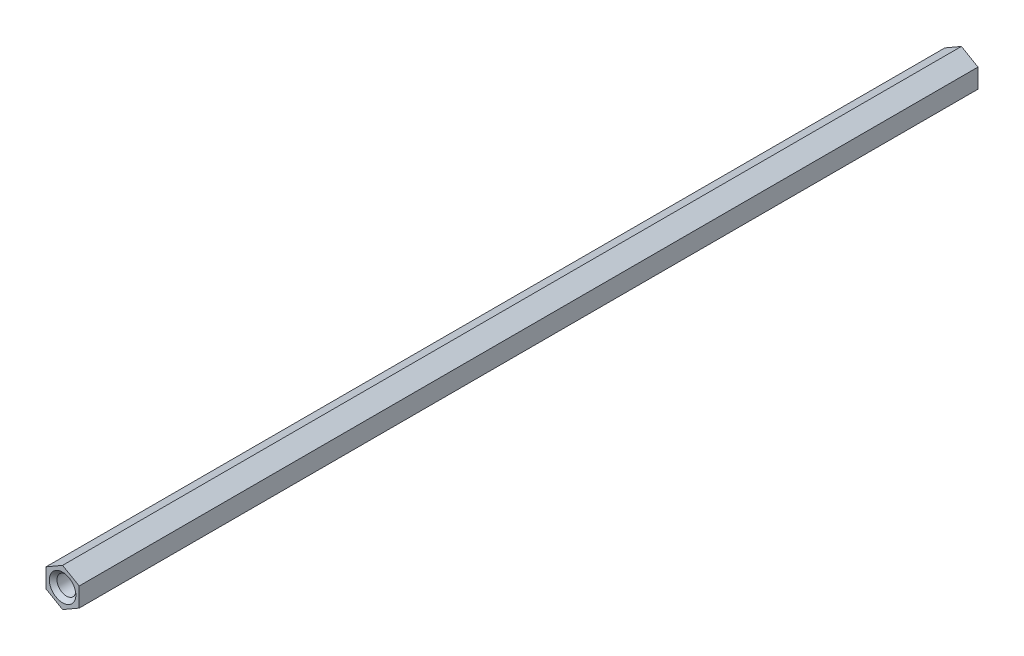
ISO-10303-21;
HEADER;
FILE_DESCRIPTION(('STEP AP214'),'2;1');
FILE_NAME('part.step','',(''),(''),'','','');
FILE_SCHEMA(('AUTOMOTIVE_DESIGN { 1 0 10303 214 1 1 1 1 }'));
ENDSEC;
DATA;
#1=APPLICATION_CONTEXT('core data for automotive mechanical design processes');
#2=APPLICATION_PROTOCOL_DEFINITION('international standard','automotive_design',2000,#1);
#3=PRODUCT_CONTEXT('',#1,'mechanical');
#4=PRODUCT('Part','Part','',(#3));
#5=PRODUCT_RELATED_PRODUCT_CATEGORY('part','',(#4));
#6=PRODUCT_DEFINITION_FORMATION('','',#4);
#7=PRODUCT_DEFINITION_CONTEXT('part definition',#1,'design');
#8=PRODUCT_DEFINITION('design','',#6,#7);
#9=PRODUCT_DEFINITION_SHAPE('','',#8);
#10=(LENGTH_UNIT() NAMED_UNIT(*) SI_UNIT(.MILLI.,.METRE.));
#11=(NAMED_UNIT(*) PLANE_ANGLE_UNIT() SI_UNIT($,.RADIAN.));
#12=(NAMED_UNIT(*) SI_UNIT($,.STERADIAN.) SOLID_ANGLE_UNIT());
#13=UNCERTAINTY_MEASURE_WITH_UNIT(LENGTH_MEASURE(1.E-05),#10,'distance_accuracy_value','');
#14=(GEOMETRIC_REPRESENTATION_CONTEXT(3) GLOBAL_UNCERTAINTY_ASSIGNED_CONTEXT((#13)) GLOBAL_UNIT_ASSIGNED_CONTEXT((#10,
#11,#12)) REPRESENTATION_CONTEXT('',''));
#15=CARTESIAN_POINT('',(0.,0.,0.));
#16=DIRECTION('',(0.,0.,1.));
#17=DIRECTION('',(1.,0.,0.));
#18=AXIS2_PLACEMENT_3D('',#15,#16,#17);
#19=CARTESIAN_POINT('',(-4.7625,2.74963065701559,129.000000000005));
#20=DIRECTION('',(0.5,-0.866025403784439,0.));
#21=DIRECTION('',(0.866025403784439,0.5,0.));
#22=AXIS2_PLACEMENT_3D('',#19,#20,#21);
#23=PLANE('',#22);
#24=DIRECTION('',(-0.866025403784439,-0.5,0.));
#25=VECTOR('',#24,1.);
#26=CARTESIAN_POINT('',(-4.7625,2.74963065701559,-129.000000000005));
#27=LINE('',#26,#25);
#28=CARTESIAN_POINT('',(0.,5.49926131403118,-129.000000000005));
#29=VERTEX_POINT('',#28);
#30=CARTESIAN_POINT('',(-4.7625,2.74963065701559,-129.000000000005));
#31=VERTEX_POINT('',#30);
#32=EDGE_CURVE('E145',#29,#31,#27,.T.);
#33=ORIENTED_EDGE('',*,*,#32,.T.);
#34=DIRECTION('',(0.,0.,-1.));
#35=VECTOR('',#34,1.);
#36=CARTESIAN_POINT('',(-4.7625,2.74963065701559,129.000000000005));
#37=LINE('',#36,#35);
#38=CARTESIAN_POINT('',(-4.7625,2.74963065701559,129.000000000005));
#39=VERTEX_POINT('',#38);
#40=EDGE_CURVE('E11',#39,#31,#37,.T.);
#41=ORIENTED_EDGE('',*,*,#40,.F.);
#42=DIRECTION('',(-0.866025403784439,-0.5,0.));
#43=VECTOR('',#42,1.);
#44=CARTESIAN_POINT('',(-4.7625,2.74963065701559,129.000000000005));
#45=LINE('',#44,#43);
#46=CARTESIAN_POINT('',(0.,5.49926131403118,129.000000000005));
#47=VERTEX_POINT('',#46);
#48=EDGE_CURVE('E162',#47,#39,#45,.T.);
#49=ORIENTED_EDGE('',*,*,#48,.F.);
#50=DIRECTION('',(0.,0.,-1.));
#51=VECTOR('',#50,1.);
#52=CARTESIAN_POINT('',(0.,5.49926131403118,129.000000000005));
#53=LINE('',#52,#51);
#54=EDGE_CURVE('E141',#47,#29,#53,.T.);
#55=ORIENTED_EDGE('',*,*,#54,.T.);
#56=EDGE_LOOP('',(#33,#41,#49,#55));
#57=FACE_BOUND('',#56,.T.);
#58=ADVANCED_FACE('F53',(#57),#23,.F.);
#59=CARTESIAN_POINT('',(-4.7625,-2.74963065701559,129.000000000005));
#60=DIRECTION('',(1.,0.,0.));
#61=DIRECTION('',(0.,1.,0.));
#62=AXIS2_PLACEMENT_3D('',#59,#60,#61);
#63=PLANE('',#62);
#64=DIRECTION('',(0.,-1.,0.));
#65=VECTOR('',#64,1.);
#66=CARTESIAN_POINT('',(-4.7625,-2.74963065701559,-129.000000000005));
#67=LINE('',#66,#65);
#68=CARTESIAN_POINT('',(-4.7625,-2.74963065701559,-129.000000000005));
#69=VERTEX_POINT('',#68);
#70=EDGE_CURVE('E149',#31,#69,#67,.T.);
#71=ORIENTED_EDGE('',*,*,#70,.T.);
#72=DIRECTION('',(0.,0.,-1.));
#73=VECTOR('',#72,1.);
#74=CARTESIAN_POINT('',(-4.7625,-2.74963065701559,129.000000000005));
#75=LINE('',#74,#73);
#76=CARTESIAN_POINT('',(-4.7625,-2.74963065701559,129.000000000005));
#77=VERTEX_POINT('',#76);
#78=EDGE_CURVE('E62',#77,#69,#75,.T.);
#79=ORIENTED_EDGE('',*,*,#78,.F.);
#80=DIRECTION('',(0.,-1.,0.));
#81=VECTOR('',#80,1.);
#82=CARTESIAN_POINT('',(-4.7625,-2.74963065701559,129.000000000005));
#83=LINE('',#82,#81);
#84=EDGE_CURVE('E108',#39,#77,#83,.T.);
#85=ORIENTED_EDGE('',*,*,#84,.F.);
#86=ORIENTED_EDGE('',*,*,#40,.T.);
#87=EDGE_LOOP('',(#71,#79,#85,#86));
#88=FACE_BOUND('',#87,.T.);
#89=ADVANCED_FACE('F191',(#88),#63,.F.);
#90=CARTESIAN_POINT('',(0.,-5.49926131403118,129.000000000005));
#91=DIRECTION('',(0.5,0.866025403784439,0.));
#92=DIRECTION('',(-0.866025403784439,0.5,0.));
#93=AXIS2_PLACEMENT_3D('',#90,#91,#92);
#94=PLANE('',#93);
#95=DIRECTION('',(0.866025403784439,-0.5,0.));
#96=VECTOR('',#95,1.);
#97=CARTESIAN_POINT('',(0.,-5.49926131403118,-129.000000000005));
#98=LINE('',#97,#96);
#99=CARTESIAN_POINT('',(0.,-5.49926131403118,-129.000000000005));
#100=VERTEX_POINT('',#99);
#101=EDGE_CURVE('E153',#69,#100,#98,.T.);
#102=ORIENTED_EDGE('',*,*,#101,.T.);
#103=DIRECTION('',(0.,0.,-1.));
#104=VECTOR('',#103,1.);
#105=CARTESIAN_POINT('',(0.,-5.49926131403118,129.000000000005));
#106=LINE('',#105,#104);
#107=CARTESIAN_POINT('',(0.,-5.49926131403118,129.000000000005));
#108=VERTEX_POINT('',#107);
#109=EDGE_CURVE('E134',#108,#100,#106,.T.);
#110=ORIENTED_EDGE('',*,*,#109,.F.);
#111=DIRECTION('',(0.866025403784439,-0.5,0.));
#112=VECTOR('',#111,1.);
#113=CARTESIAN_POINT('',(0.,-5.49926131403118,129.000000000005));
#114=LINE('',#113,#112);
#115=EDGE_CURVE('E123',#77,#108,#114,.T.);
#116=ORIENTED_EDGE('',*,*,#115,.F.);
#117=ORIENTED_EDGE('',*,*,#78,.T.);
#118=EDGE_LOOP('',(#102,#110,#116,#117));
#119=FACE_BOUND('',#118,.T.);
#120=ADVANCED_FACE('F172',(#119),#94,.F.);
#121=CARTESIAN_POINT('',(4.7625,-2.7496306570156,129.000000000005));
#122=DIRECTION('',(-0.5,0.866025403784439,0.));
#123=DIRECTION('',(-0.866025403784439,-0.5,0.));
#124=AXIS2_PLACEMENT_3D('',#121,#122,#123);
#125=PLANE('',#124);
#126=DIRECTION('',(0.866025403784439,0.5,0.));
#127=VECTOR('',#126,1.);
#128=CARTESIAN_POINT('',(4.7625,-2.7496306570156,-129.000000000005));
#129=LINE('',#128,#127);
#130=CARTESIAN_POINT('',(4.7625,-2.7496306570156,-129.000000000005));
#131=VERTEX_POINT('',#130);
#132=EDGE_CURVE('E132',#100,#131,#129,.T.);
#133=ORIENTED_EDGE('',*,*,#132,.T.);
#134=DIRECTION('',(0.,0.,-1.));
#135=VECTOR('',#134,1.);
#136=CARTESIAN_POINT('',(4.7625,-2.7496306570156,129.000000000005));
#137=LINE('',#136,#135);
#138=CARTESIAN_POINT('',(4.7625,-2.7496306570156,129.000000000005));
#139=VERTEX_POINT('',#138);
#140=EDGE_CURVE('E129',#139,#131,#137,.T.);
#141=ORIENTED_EDGE('',*,*,#140,.F.);
#142=DIRECTION('',(0.866025403784439,0.5,0.));
#143=VECTOR('',#142,1.);
#144=CARTESIAN_POINT('',(4.7625,-2.7496306570156,129.000000000005));
#145=LINE('',#144,#143);
#146=EDGE_CURVE('E117',#108,#139,#145,.T.);
#147=ORIENTED_EDGE('',*,*,#146,.F.);
#148=ORIENTED_EDGE('',*,*,#109,.T.);
#149=EDGE_LOOP('',(#133,#141,#147,#148));
#150=FACE_BOUND('',#149,.T.);
#151=ADVANCED_FACE('F130',(#150),#125,.F.);
#152=CARTESIAN_POINT('',(4.7625,2.74963065701559,129.000000000005));
#153=DIRECTION('',(-1.,0.,0.));
#154=DIRECTION('',(0.,0.,1.));
#155=AXIS2_PLACEMENT_3D('',#152,#153,#154);
#156=PLANE('',#155);
#157=DIRECTION('',(0.,1.,0.));
#158=VECTOR('',#157,1.);
#159=CARTESIAN_POINT('',(4.7625,2.74963065701559,-129.000000000005));
#160=LINE('',#159,#158);
#161=CARTESIAN_POINT('',(4.7625,2.74963065701559,-129.000000000005));
#162=VERTEX_POINT('',#161);
#163=EDGE_CURVE('E94',#131,#162,#160,.T.);
#164=ORIENTED_EDGE('',*,*,#163,.T.);
#165=DIRECTION('',(0.,0.,-1.));
#166=VECTOR('',#165,1.);
#167=CARTESIAN_POINT('',(4.7625,2.74963065701559,129.000000000005));
#168=LINE('',#167,#166);
#169=CARTESIAN_POINT('',(4.7625,2.74963065701559,129.000000000005));
#170=VERTEX_POINT('',#169);
#171=EDGE_CURVE('E135',#170,#162,#168,.T.);
#172=ORIENTED_EDGE('',*,*,#171,.F.);
#173=DIRECTION('',(0.,1.,0.));
#174=VECTOR('',#173,1.);
#175=CARTESIAN_POINT('',(4.7625,2.74963065701559,129.000000000005));
#176=LINE('',#175,#174);
#177=EDGE_CURVE('E121',#139,#170,#176,.T.);
#178=ORIENTED_EDGE('',*,*,#177,.F.);
#179=ORIENTED_EDGE('',*,*,#140,.T.);
#180=EDGE_LOOP('',(#164,#172,#178,#179));
#181=FACE_BOUND('',#180,.T.);
#182=ADVANCED_FACE('F137',(#181),#156,.F.);
#183=CARTESIAN_POINT('',(0.,5.49926131403118,129.000000000005));
#184=DIRECTION('',(-0.5,-0.866025403784439,0.));
#185=DIRECTION('',(0.866025403784439,-0.5,0.));
#186=AXIS2_PLACEMENT_3D('',#183,#184,#185);
#187=PLANE('',#186);
#188=DIRECTION('',(-0.866025403784439,0.5,0.));
#189=VECTOR('',#188,1.);
#190=CARTESIAN_POINT('',(0.,5.49926131403118,-129.000000000005));
#191=LINE('',#190,#189);
#192=EDGE_CURVE('E100',#162,#29,#191,.T.);
#193=ORIENTED_EDGE('',*,*,#192,.T.);
#194=ORIENTED_EDGE('',*,*,#54,.F.);
#195=DIRECTION('',(-0.866025403784439,0.5,0.));
#196=VECTOR('',#195,1.);
#197=CARTESIAN_POINT('',(0.,5.49926131403118,129.000000000005));
#198=LINE('',#197,#196);
#199=EDGE_CURVE('E70',#170,#47,#198,.T.);
#200=ORIENTED_EDGE('',*,*,#199,.F.);
#201=ORIENTED_EDGE('',*,*,#171,.T.);
#202=EDGE_LOOP('',(#193,#194,#200,#201));
#203=FACE_BOUND('',#202,.T.);
#204=ADVANCED_FACE('F179',(#203),#187,.F.);
#205=CARTESIAN_POINT('',(0.,0.,129.000000000005));
#206=DIRECTION('',(0.,0.,-1.));
#207=DIRECTION('',(-1.,0.,0.));
#208=AXIS2_PLACEMENT_3D('',#205,#206,#207);
#209=PLANE('',#208);
#210=CARTESIAN_POINT('',(0.,0.,129.000000000005));
#211=DIRECTION('',(0.,0.,1.));
#212=DIRECTION('',(1.,0.,0.));
#213=AXIS2_PLACEMENT_3D('',#210,#211,#212);
#214=CIRCLE('',#213,3.81);
#215=CARTESIAN_POINT('',(3.81,0.,129.000000000005));
#216=VERTEX_POINT('',#215);
#217=EDGE_CURVE('E312',#216,#216,#214,.T.);
#218=ORIENTED_EDGE('',*,*,#217,.F.);
#219=EDGE_LOOP('',(#218));
#220=FACE_BOUND('',#219,.T.);
#221=ORIENTED_EDGE('',*,*,#48,.T.);
#222=ORIENTED_EDGE('',*,*,#84,.T.);
#223=ORIENTED_EDGE('',*,*,#115,.T.);
#224=ORIENTED_EDGE('',*,*,#146,.T.);
#225=ORIENTED_EDGE('',*,*,#177,.T.);
#226=ORIENTED_EDGE('',*,*,#199,.T.);
#227=EDGE_LOOP('',(#221,#222,#223,#224,#225,#226));
#228=FACE_BOUND('',#227,.T.);
#229=ADVANCED_FACE('F119',(#220,#228),#209,.F.);
#230=CARTESIAN_POINT('',(0.,0.,-129.000000000005));
#231=DIRECTION('',(0.,0.,-1.));
#232=DIRECTION('',(-1.,0.,0.));
#233=AXIS2_PLACEMENT_3D('',#230,#231,#232);
#234=PLANE('',#233);
#235=CARTESIAN_POINT('',(0.,0.,-129.000000000005));
#236=DIRECTION('',(0.,0.,-1.));
#237=DIRECTION('',(-1.,0.,0.));
#238=AXIS2_PLACEMENT_3D('',#235,#236,#237);
#239=CIRCLE('',#238,3.81);
#240=CARTESIAN_POINT('',(-3.81,0.,-129.000000000005));
#241=VERTEX_POINT('',#240);
#242=EDGE_CURVE('E302',#241,#241,#239,.T.);
#243=ORIENTED_EDGE('',*,*,#242,.F.);
#244=EDGE_LOOP('',(#243));
#245=FACE_BOUND('',#244,.T.);
#246=ORIENTED_EDGE('',*,*,#32,.F.);
#247=ORIENTED_EDGE('',*,*,#192,.F.);
#248=ORIENTED_EDGE('',*,*,#163,.F.);
#249=ORIENTED_EDGE('',*,*,#132,.F.);
#250=ORIENTED_EDGE('',*,*,#101,.F.);
#251=ORIENTED_EDGE('',*,*,#70,.F.);
#252=EDGE_LOOP('',(#246,#247,#248,#249,#250,#251));
#253=FACE_BOUND('',#252,.T.);
#254=ADVANCED_FACE('F175',(#245,#253),#234,.T.);
#255=CARTESIAN_POINT('',(0.,0.,113.760000000005));
#256=DIRECTION('',(0.,0.,1.));
#257=DIRECTION('',(1.,0.,0.));
#258=AXIS2_PLACEMENT_3D('',#255,#256,#257);
#259=CONICAL_SURFACE('',#258,2.7051,1.02974425867665);
#260=CARTESIAN_POINT('',(0.,0.,112.134611939473));
#261=VERTEX_POINT('',#260);
#262=VERTEX_LOOP('',#261);
#263=FACE_BOUND('',#262,.T.);
#264=CARTESIAN_POINT('',(0.,0.,113.760000000005));
#265=DIRECTION('',(0.,0.,1.));
#266=DIRECTION('',(1.,0.,0.));
#267=AXIS2_PLACEMENT_3D('',#264,#265,#266);
#268=CIRCLE('',#267,2.7051);
#269=CARTESIAN_POINT('',(2.7051,0.,113.760000000005));
#270=VERTEX_POINT('',#269);
#271=EDGE_CURVE('E150',#270,#270,#268,.T.);
#272=ORIENTED_EDGE('',*,*,#271,.T.);
#273=EDGE_LOOP('',(#272));
#274=FACE_BOUND('',#273,.T.);
#275=ADVANCED_FACE('F231',(#263,#274),#259,.F.);
#276=CARTESIAN_POINT('',(0.,0.,129.000000000005));
#277=DIRECTION('',(0.,0.,1.));
#278=DIRECTION('',(1.,0.,0.));
#279=AXIS2_PLACEMENT_3D('',#276,#277,#278);
#280=CYLINDRICAL_SURFACE('',#279,2.7051);
#281=ORIENTED_EDGE('',*,*,#271,.F.);
#282=EDGE_LOOP('',(#281));
#283=FACE_BOUND('',#282,.T.);
#284=CARTESIAN_POINT('',(0.,0.,127.895100000005));
#285=DIRECTION('',(0.,0.,1.));
#286=DIRECTION('',(1.,0.,0.));
#287=AXIS2_PLACEMENT_3D('',#284,#285,#286);
#288=CIRCLE('',#287,2.7051);
#289=CARTESIAN_POINT('',(2.7051,0.,127.895100000005));
#290=VERTEX_POINT('',#289);
#291=EDGE_CURVE('E316',#290,#290,#288,.T.);
#292=ORIENTED_EDGE('',*,*,#291,.T.);
#293=EDGE_LOOP('',(#292));
#294=FACE_BOUND('',#293,.T.);
#295=ADVANCED_FACE('F241',(#283,#294),#280,.F.);
#296=CARTESIAN_POINT('',(0.,0.,129.000000000005));
#297=DIRECTION('',(0.,0.,1.));
#298=DIRECTION('',(1.,0.,0.));
#299=AXIS2_PLACEMENT_3D('',#296,#297,#298);
#300=CONICAL_SURFACE('',#299,3.81,0.785398163397453);
#301=ORIENTED_EDGE('',*,*,#291,.F.);
#302=EDGE_LOOP('',(#301));
#303=FACE_BOUND('',#302,.T.);
#304=ORIENTED_EDGE('',*,*,#217,.T.);
#305=EDGE_LOOP('',(#304));
#306=FACE_BOUND('',#305,.T.);
#307=ADVANCED_FACE('F252',(#303,#306),#300,.F.);
#308=CARTESIAN_POINT('',(0.,0.,-111.766100000005));
#309=DIRECTION('',(0.,0.,-1.));
#310=DIRECTION('',(-1.,0.,0.));
#311=AXIS2_PLACEMENT_3D('',#308,#309,#310);
#312=CONICAL_SURFACE('',#311,2.7051,1.02974425867665);
#313=CARTESIAN_POINT('',(0.,0.,-110.140711939473));
#314=VERTEX_POINT('',#313);
#315=VERTEX_LOOP('',#314);
#316=FACE_BOUND('',#315,.T.);
#317=CARTESIAN_POINT('',(0.,0.,-111.766100000005));
#318=DIRECTION('',(0.,0.,-1.));
#319=DIRECTION('',(-1.,0.,0.));
#320=AXIS2_PLACEMENT_3D('',#317,#318,#319);
#321=CIRCLE('',#320,2.7051);
#322=CARTESIAN_POINT('',(-2.7051,0.,-111.766100000005));
#323=VERTEX_POINT('',#322);
#324=EDGE_CURVE('E306',#323,#323,#321,.T.);
#325=ORIENTED_EDGE('',*,*,#324,.T.);
#326=EDGE_LOOP('',(#325));
#327=FACE_BOUND('',#326,.T.);
#328=ADVANCED_FACE('F262',(#316,#327),#312,.F.);
#329=CARTESIAN_POINT('',(0.,0.,-129.000000000005));
#330=DIRECTION('',(0.,0.,-1.));
#331=DIRECTION('',(-1.,0.,0.));
#332=AXIS2_PLACEMENT_3D('',#329,#330,#331);
#333=CYLINDRICAL_SURFACE('',#332,2.7051);
#334=ORIENTED_EDGE('',*,*,#324,.F.);
#335=EDGE_LOOP('',(#334));
#336=FACE_BOUND('',#335,.T.);
#337=CARTESIAN_POINT('',(0.,0.,-127.895100000005));
#338=DIRECTION('',(0.,0.,-1.));
#339=DIRECTION('',(-1.,0.,0.));
#340=AXIS2_PLACEMENT_3D('',#337,#338,#339);
#341=CIRCLE('',#340,2.7051);
#342=CARTESIAN_POINT('',(-2.7051,0.,-127.895100000005));
#343=VERTEX_POINT('',#342);
#344=EDGE_CURVE('E299',#343,#343,#341,.T.);
#345=ORIENTED_EDGE('',*,*,#344,.T.);
#346=EDGE_LOOP('',(#345));
#347=FACE_BOUND('',#346,.T.);
#348=ADVANCED_FACE('F271',(#336,#347),#333,.F.);
#349=CARTESIAN_POINT('',(0.,0.,-129.000000000005));
#350=DIRECTION('',(0.,0.,-1.));
#351=DIRECTION('',(-1.,0.,0.));
#352=AXIS2_PLACEMENT_3D('',#349,#350,#351);
#353=CONICAL_SURFACE('',#352,3.81,0.785398163397452);
#354=ORIENTED_EDGE('',*,*,#344,.F.);
#355=EDGE_LOOP('',(#354));
#356=FACE_BOUND('',#355,.T.);
#357=ORIENTED_EDGE('',*,*,#242,.T.);
#358=EDGE_LOOP('',(#357));
#359=FACE_BOUND('',#358,.T.);
#360=ADVANCED_FACE('F282',(#356,#359),#353,.F.);
#361=CLOSED_SHELL('',(#58,#89,#120,#151,#182,#204,#229,#254,#275,#295,#307,#328,#348,#360));
#362=MANIFOLD_SOLID_BREP('B2',#361);
#363=ADVANCED_BREP_SHAPE_REPRESENTATION('',(#18,#362),#14);
#364=SHAPE_DEFINITION_REPRESENTATION(#9,#363);
ENDSEC;
END-ISO-10303-21;
